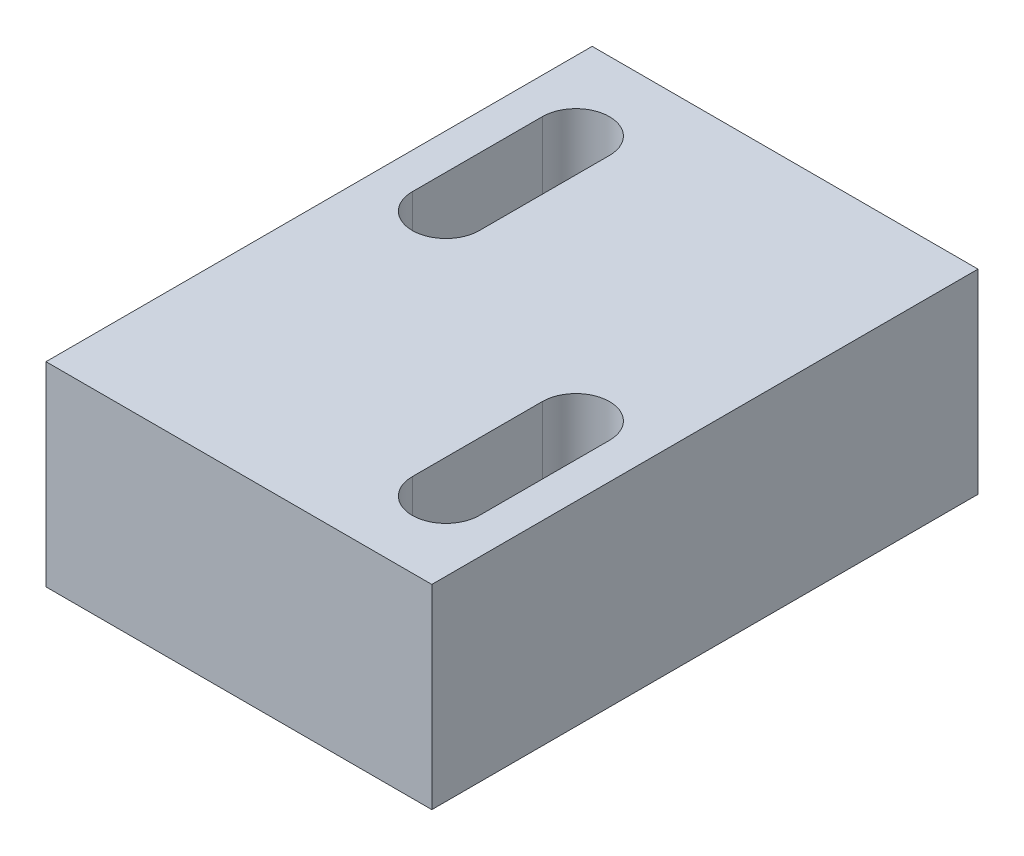
ISO-10303-21;
HEADER;
FILE_DESCRIPTION(('STEP AP214'),'2;1');
FILE_NAME('part.step','',(''),(''),'','','');
FILE_SCHEMA(('AUTOMOTIVE_DESIGN { 1 0 10303 214 1 1 1 1 }'));
ENDSEC;
DATA;
#1=APPLICATION_CONTEXT('core data for automotive mechanical design processes');
#2=APPLICATION_PROTOCOL_DEFINITION('international standard','automotive_design',2000,#1);
#3=PRODUCT_CONTEXT('',#1,'mechanical');
#4=PRODUCT('Part','Part','',(#3));
#5=PRODUCT_RELATED_PRODUCT_CATEGORY('part','',(#4));
#6=PRODUCT_DEFINITION_FORMATION('','',#4);
#7=PRODUCT_DEFINITION_CONTEXT('part definition',#1,'design');
#8=PRODUCT_DEFINITION('design','',#6,#7);
#9=PRODUCT_DEFINITION_SHAPE('','',#8);
#10=(LENGTH_UNIT() NAMED_UNIT(*) SI_UNIT(.MILLI.,.METRE.));
#11=(NAMED_UNIT(*) PLANE_ANGLE_UNIT() SI_UNIT($,.RADIAN.));
#12=(NAMED_UNIT(*) SI_UNIT($,.STERADIAN.) SOLID_ANGLE_UNIT());
#13=UNCERTAINTY_MEASURE_WITH_UNIT(LENGTH_MEASURE(1.E-05),#10,'distance_accuracy_value','');
#14=(GEOMETRIC_REPRESENTATION_CONTEXT(3) GLOBAL_UNCERTAINTY_ASSIGNED_CONTEXT((#13)) GLOBAL_UNIT_ASSIGNED_CONTEXT((#10,
#11,#12)) REPRESENTATION_CONTEXT('',''));
#15=CARTESIAN_POINT('',(0.,0.,0.));
#16=DIRECTION('',(0.,0.,1.));
#17=DIRECTION('',(1.,0.,0.));
#18=AXIS2_PLACEMENT_3D('',#15,#16,#17);
#19=CARTESIAN_POINT('',(-17.5,9.,-12.6));
#20=DIRECTION('',(0.,0.,1.));
#21=DIRECTION('',(1.,0.,0.));
#22=AXIS2_PLACEMENT_3D('',#19,#20,#21);
#23=PLANE('',#22);
#24=DIRECTION('',(-1.,0.,0.));
#25=VECTOR('',#24,1.);
#26=CARTESIAN_POINT('',(-17.5,9.,-12.6));
#27=LINE('',#26,#25);
#28=CARTESIAN_POINT('',(0.301927708294968,9.,-12.6));
#29=VERTEX_POINT('',#28);
#30=CARTESIAN_POINT('',(-17.5,9.,-12.6));
#31=VERTEX_POINT('',#30);
#32=EDGE_CURVE('E141',#29,#31,#27,.T.);
#33=ORIENTED_EDGE('',*,*,#32,.F.);
#34=DIRECTION('',(0.,-1.,0.));
#35=VECTOR('',#34,1.);
#36=CARTESIAN_POINT('',(0.301927708294968,9.,-12.6));
#37=LINE('',#36,#35);
#38=CARTESIAN_POINT('',(0.301927708294968,0.,-12.6));
#39=VERTEX_POINT('',#38);
#40=EDGE_CURVE('E121',#29,#39,#37,.T.);
#41=ORIENTED_EDGE('',*,*,#40,.T.);
#42=DIRECTION('',(-1.,0.,0.));
#43=VECTOR('',#42,1.);
#44=CARTESIAN_POINT('',(-17.5,0.,-12.6));
#45=LINE('',#44,#43);
#46=CARTESIAN_POINT('',(-17.5,0.,-12.6));
#47=VERTEX_POINT('',#46);
#48=EDGE_CURVE('E145',#39,#47,#45,.T.);
#49=ORIENTED_EDGE('',*,*,#48,.T.);
#50=DIRECTION('',(0.,-1.,0.));
#51=VECTOR('',#50,1.);
#52=CARTESIAN_POINT('',(-17.5,9.,-12.6));
#53=LINE('',#52,#51);
#54=EDGE_CURVE('E11',#31,#47,#53,.T.);
#55=ORIENTED_EDGE('',*,*,#54,.F.);
#56=EDGE_LOOP('',(#33,#41,#49,#55));
#57=FACE_BOUND('',#56,.T.);
#58=ADVANCED_FACE('F32',(#57),#23,.F.);
#59=CARTESIAN_POINT('',(-17.5,9.,12.6));
#60=DIRECTION('',(1.,0.,0.));
#61=DIRECTION('',(0.,0.,-1.));
#62=AXIS2_PLACEMENT_3D('',#59,#60,#61);
#63=PLANE('',#62);
#64=DIRECTION('',(0.,0.,1.));
#65=VECTOR('',#64,1.);
#66=CARTESIAN_POINT('',(-17.5,0.,12.6));
#67=LINE('',#66,#65);
#68=CARTESIAN_POINT('',(-17.5,0.,12.6));
#69=VERTEX_POINT('',#68);
#70=EDGE_CURVE('E147',#47,#69,#67,.T.);
#71=ORIENTED_EDGE('',*,*,#70,.T.);
#72=DIRECTION('',(0.,-1.,0.));
#73=VECTOR('',#72,1.);
#74=CARTESIAN_POINT('',(-17.5,9.,12.6));
#75=LINE('',#74,#73);
#76=CARTESIAN_POINT('',(-17.5,9.,12.6));
#77=VERTEX_POINT('',#76);
#78=EDGE_CURVE('E39',#77,#69,#75,.T.);
#79=ORIENTED_EDGE('',*,*,#78,.F.);
#80=DIRECTION('',(0.,0.,1.));
#81=VECTOR('',#80,1.);
#82=CARTESIAN_POINT('',(-17.5,9.,12.6));
#83=LINE('',#82,#81);
#84=EDGE_CURVE('E138',#31,#77,#83,.T.);
#85=ORIENTED_EDGE('',*,*,#84,.F.);
#86=ORIENTED_EDGE('',*,*,#54,.T.);
#87=EDGE_LOOP('',(#71,#79,#85,#86));
#88=FACE_BOUND('',#87,.T.);
#89=ADVANCED_FACE('F221',(#88),#63,.F.);
#90=CARTESIAN_POINT('',(-17.5,9.,12.6));
#91=DIRECTION('',(0.,0.,-1.));
#92=DIRECTION('',(-1.,0.,0.));
#93=AXIS2_PLACEMENT_3D('',#90,#91,#92);
#94=PLANE('',#93);
#95=DIRECTION('',(1.,0.,0.));
#96=VECTOR('',#95,1.);
#97=CARTESIAN_POINT('',(-17.5,0.,12.6));
#98=LINE('',#97,#96);
#99=CARTESIAN_POINT('',(0.301927708294968,0.,12.6));
#100=VERTEX_POINT('',#99);
#101=EDGE_CURVE('E134',#69,#100,#98,.T.);
#102=ORIENTED_EDGE('',*,*,#101,.T.);
#103=DIRECTION('',(0.,-1.,0.));
#104=VECTOR('',#103,1.);
#105=CARTESIAN_POINT('',(0.301927708294968,9.,12.6));
#106=LINE('',#105,#104);
#107=CARTESIAN_POINT('',(0.301927708294968,9.,12.6));
#108=VERTEX_POINT('',#107);
#109=EDGE_CURVE('E46',#108,#100,#106,.T.);
#110=ORIENTED_EDGE('',*,*,#109,.F.);
#111=DIRECTION('',(1.,0.,0.));
#112=VECTOR('',#111,1.);
#113=CARTESIAN_POINT('',(-17.5,9.,12.6));
#114=LINE('',#113,#112);
#115=EDGE_CURVE('E132',#77,#108,#114,.T.);
#116=ORIENTED_EDGE('',*,*,#115,.F.);
#117=ORIENTED_EDGE('',*,*,#78,.T.);
#118=EDGE_LOOP('',(#102,#110,#116,#117));
#119=FACE_BOUND('',#118,.T.);
#120=ADVANCED_FACE('F130',(#119),#94,.F.);
#121=CARTESIAN_POINT('',(0.,9.,0.));
#122=DIRECTION('',(0.,-1.,0.));
#123=DIRECTION('',(0.,0.,-1.));
#124=AXIS2_PLACEMENT_3D('',#121,#122,#123);
#125=PLANE('',#124);
#126=DIRECTION('',(0.,0.,1.));
#127=VECTOR('',#126,1.);
#128=CARTESIAN_POINT('',(-12.7408903953449,9.,-8.64));
#129=LINE('',#128,#127);
#130=CARTESIAN_POINT('',(-12.7408903953449,9.,-8.64));
#131=VERTEX_POINT('',#130);
#132=CARTESIAN_POINT('',(-12.7408903953449,9.,-2.64));
#133=VERTEX_POINT('',#132);
#134=EDGE_CURVE('E188',#131,#133,#129,.T.);
#135=ORIENTED_EDGE('',*,*,#134,.T.);
#136=CARTESIAN_POINT('',(-14.2908903953449,9.,-2.64));
#137=DIRECTION('',(0.,-1.,0.));
#138=DIRECTION('',(0.,0.,-1.));
#139=AXIS2_PLACEMENT_3D('',#136,#137,#138);
#140=CIRCLE('',#139,1.55);
#141=CARTESIAN_POINT('',(-15.8408903953449,9.,-2.64));
#142=VERTEX_POINT('',#141);
#143=EDGE_CURVE('E196',#133,#142,#140,.T.);
#144=ORIENTED_EDGE('',*,*,#143,.T.);
#145=DIRECTION('',(0.,0.,-1.));
#146=VECTOR('',#145,1.);
#147=CARTESIAN_POINT('',(-15.8408903953449,9.,-8.64));
#148=LINE('',#147,#146);
#149=CARTESIAN_POINT('',(-15.8408903953449,9.,-8.64));
#150=VERTEX_POINT('',#149);
#151=EDGE_CURVE('E208',#142,#150,#148,.T.);
#152=ORIENTED_EDGE('',*,*,#151,.T.);
#153=CARTESIAN_POINT('',(-14.2908903953449,9.,-8.64));
#154=DIRECTION('',(0.,-1.,0.));
#155=DIRECTION('',(0.,0.,-1.));
#156=AXIS2_PLACEMENT_3D('',#153,#154,#155);
#157=CIRCLE('',#156,1.55);
#158=EDGE_CURVE('E54',#150,#131,#157,.T.);
#159=ORIENTED_EDGE('',*,*,#158,.T.);
#160=EDGE_LOOP('',(#135,#144,#152,#159));
#161=FACE_BOUND('',#160,.T.);
#162=DIRECTION('',(0.,0.,1.));
#163=VECTOR('',#162,1.);
#164=CARTESIAN_POINT('',(-1.35718189636012,9.,2.74370849898473));
#165=LINE('',#164,#163);
#166=CARTESIAN_POINT('',(-1.35718189636012,9.,2.74370849898473));
#167=VERTEX_POINT('',#166);
#168=CARTESIAN_POINT('',(-1.35718189636012,9.,8.74370849898472));
#169=VERTEX_POINT('',#168);
#170=EDGE_CURVE('E156',#167,#169,#165,.T.);
#171=ORIENTED_EDGE('',*,*,#170,.T.);
#172=CARTESIAN_POINT('',(-2.90718189636012,9.,8.74370849898473));
#173=DIRECTION('',(0.,-1.,0.));
#174=DIRECTION('',(0.,0.,-1.));
#175=AXIS2_PLACEMENT_3D('',#172,#173,#174);
#176=CIRCLE('',#175,1.55);
#177=CARTESIAN_POINT('',(-4.45718189636012,9.,8.74370849898473));
#178=VERTEX_POINT('',#177);
#179=EDGE_CURVE('E164',#169,#178,#176,.T.);
#180=ORIENTED_EDGE('',*,*,#179,.T.);
#181=DIRECTION('',(0.,0.,-1.));
#182=VECTOR('',#181,1.);
#183=CARTESIAN_POINT('',(-4.45718189636012,9.,2.74370849898473));
#184=LINE('',#183,#182);
#185=CARTESIAN_POINT('',(-4.45718189636012,9.,2.74370849898473));
#186=VERTEX_POINT('',#185);
#187=EDGE_CURVE('E179',#178,#186,#184,.T.);
#188=ORIENTED_EDGE('',*,*,#187,.T.);
#189=CARTESIAN_POINT('',(-2.90718189636012,9.,2.74370849898473));
#190=DIRECTION('',(0.,-1.,0.));
#191=DIRECTION('',(0.,0.,-1.));
#192=AXIS2_PLACEMENT_3D('',#189,#190,#191);
#193=CIRCLE('',#192,1.55);
#194=EDGE_CURVE('E176',#186,#167,#193,.T.);
#195=ORIENTED_EDGE('',*,*,#194,.T.);
#196=EDGE_LOOP('',(#171,#180,#188,#195));
#197=FACE_BOUND('',#196,.T.);
#198=ORIENTED_EDGE('',*,*,#115,.T.);
#199=DIRECTION('',(0.,0.,-1.));
#200=VECTOR('',#199,1.);
#201=CARTESIAN_POINT('',(0.301927708294968,9.,-12.6));
#202=LINE('',#201,#200);
#203=EDGE_CURVE('E118',#108,#29,#202,.T.);
#204=ORIENTED_EDGE('',*,*,#203,.T.);
#205=ORIENTED_EDGE('',*,*,#32,.T.);
#206=ORIENTED_EDGE('',*,*,#84,.T.);
#207=EDGE_LOOP('',(#198,#204,#205,#206));
#208=FACE_BOUND('',#207,.T.);
#209=ADVANCED_FACE('F136',(#161,#197,#208),#125,.F.);
#210=CARTESIAN_POINT('',(0.,0.,0.));
#211=DIRECTION('',(0.,-1.,0.));
#212=DIRECTION('',(0.,0.,-1.));
#213=AXIS2_PLACEMENT_3D('',#210,#211,#212);
#214=PLANE('',#213);
#215=DIRECTION('',(0.,0.,-1.));
#216=VECTOR('',#215,1.);
#217=CARTESIAN_POINT('',(0.301927708294968,0.,-12.6));
#218=LINE('',#217,#216);
#219=EDGE_CURVE('E125',#100,#39,#218,.T.);
#220=ORIENTED_EDGE('',*,*,#219,.F.);
#221=ORIENTED_EDGE('',*,*,#101,.F.);
#222=ORIENTED_EDGE('',*,*,#70,.F.);
#223=ORIENTED_EDGE('',*,*,#48,.F.);
#224=EDGE_LOOP('',(#220,#221,#222,#223));
#225=FACE_BOUND('',#224,.T.);
#226=CARTESIAN_POINT('',(-14.2908903953449,0.,-2.64));
#227=DIRECTION('',(0.,-1.,0.));
#228=DIRECTION('',(0.,0.,-1.));
#229=AXIS2_PLACEMENT_3D('',#226,#227,#228);
#230=CIRCLE('',#229,1.55);
#231=CARTESIAN_POINT('',(-12.7408903953449,0.,-2.64));
#232=VERTEX_POINT('',#231);
#233=CARTESIAN_POINT('',(-15.8408903953449,0.,-2.64));
#234=VERTEX_POINT('',#233);
#235=EDGE_CURVE('E203',#232,#234,#230,.T.);
#236=ORIENTED_EDGE('',*,*,#235,.F.);
#237=DIRECTION('',(0.,0.,1.));
#238=VECTOR('',#237,1.);
#239=CARTESIAN_POINT('',(-12.7408903953449,0.,-8.64));
#240=LINE('',#239,#238);
#241=CARTESIAN_POINT('',(-12.7408903953449,0.,-8.64));
#242=VERTEX_POINT('',#241);
#243=EDGE_CURVE('E193',#242,#232,#240,.T.);
#244=ORIENTED_EDGE('',*,*,#243,.F.);
#245=CARTESIAN_POINT('',(-14.2908903953449,0.,-8.64));
#246=DIRECTION('',(0.,-1.,0.));
#247=DIRECTION('',(0.,0.,-1.));
#248=AXIS2_PLACEMENT_3D('',#245,#246,#247);
#249=CIRCLE('',#248,1.55);
#250=CARTESIAN_POINT('',(-15.8408903953449,0.,-8.64));
#251=VERTEX_POINT('',#250);
#252=EDGE_CURVE('E197',#251,#242,#249,.T.);
#253=ORIENTED_EDGE('',*,*,#252,.F.);
#254=DIRECTION('',(0.,0.,-1.));
#255=VECTOR('',#254,1.);
#256=CARTESIAN_POINT('',(-15.8408903953449,0.,-8.64));
#257=LINE('',#256,#255);
#258=EDGE_CURVE('E200',#234,#251,#257,.T.);
#259=ORIENTED_EDGE('',*,*,#258,.F.);
#260=EDGE_LOOP('',(#236,#244,#253,#259));
#261=FACE_BOUND('',#260,.T.);
#262=CARTESIAN_POINT('',(-2.90718189636012,0.,8.74370849898473));
#263=DIRECTION('',(0.,-1.,0.));
#264=DIRECTION('',(0.,0.,-1.));
#265=AXIS2_PLACEMENT_3D('',#262,#263,#264);
#266=CIRCLE('',#265,1.55);
#267=CARTESIAN_POINT('',(-1.35718189636012,0.,8.74370849898472));
#268=VERTEX_POINT('',#267);
#269=CARTESIAN_POINT('',(-4.45718189636012,0.,8.74370849898473));
#270=VERTEX_POINT('',#269);
#271=EDGE_CURVE('E171',#268,#270,#266,.T.);
#272=ORIENTED_EDGE('',*,*,#271,.F.);
#273=DIRECTION('',(0.,0.,1.));
#274=VECTOR('',#273,1.);
#275=CARTESIAN_POINT('',(-1.35718189636012,0.,2.74370849898473));
#276=LINE('',#275,#274);
#277=CARTESIAN_POINT('',(-1.35718189636012,0.,2.74370849898473));
#278=VERTEX_POINT('',#277);
#279=EDGE_CURVE('E161',#278,#268,#276,.T.);
#280=ORIENTED_EDGE('',*,*,#279,.F.);
#281=CARTESIAN_POINT('',(-2.90718189636012,0.,2.74370849898473));
#282=DIRECTION('',(0.,-1.,0.));
#283=DIRECTION('',(0.,0.,-1.));
#284=AXIS2_PLACEMENT_3D('',#281,#282,#283);
#285=CIRCLE('',#284,1.55);
#286=CARTESIAN_POINT('',(-4.45718189636012,0.,2.74370849898473));
#287=VERTEX_POINT('',#286);
#288=EDGE_CURVE('E165',#287,#278,#285,.T.);
#289=ORIENTED_EDGE('',*,*,#288,.F.);
#290=DIRECTION('',(0.,0.,-1.));
#291=VECTOR('',#290,1.);
#292=CARTESIAN_POINT('',(-4.45718189636012,0.,2.74370849898473));
#293=LINE('',#292,#291);
#294=EDGE_CURVE('E168',#270,#287,#293,.T.);
#295=ORIENTED_EDGE('',*,*,#294,.F.);
#296=EDGE_LOOP('',(#272,#280,#289,#295));
#297=FACE_BOUND('',#296,.T.);
#298=ADVANCED_FACE('F218',(#225,#261,#297),#214,.T.);
#299=CARTESIAN_POINT('',(-2.90718189636012,9.,8.74370849898473));
#300=DIRECTION('',(0.,-1.,0.));
#301=DIRECTION('',(0.,0.,-1.));
#302=AXIS2_PLACEMENT_3D('',#299,#300,#301);
#303=CYLINDRICAL_SURFACE('',#302,1.55);
#304=ORIENTED_EDGE('',*,*,#271,.T.);
#305=DIRECTION('',(0.,-1.,0.));
#306=VECTOR('',#305,1.);
#307=CARTESIAN_POINT('',(-4.45718189636012,9.,8.74370849898473));
#308=LINE('',#307,#306);
#309=EDGE_CURVE('E152',#178,#270,#308,.T.);
#310=ORIENTED_EDGE('',*,*,#309,.F.);
#311=ORIENTED_EDGE('',*,*,#179,.F.);
#312=DIRECTION('',(0.,-1.,0.));
#313=VECTOR('',#312,1.);
#314=CARTESIAN_POINT('',(-1.35718189636012,9.,8.74370849898472));
#315=LINE('',#314,#313);
#316=EDGE_CURVE('E148',#169,#268,#315,.T.);
#317=ORIENTED_EDGE('',*,*,#316,.T.);
#318=EDGE_LOOP('',(#304,#310,#311,#317));
#319=FACE_BOUND('',#318,.T.);
#320=ADVANCED_FACE('F231',(#319),#303,.F.);
#321=CARTESIAN_POINT('',(-1.35718189636012,9.,2.74370849898473));
#322=DIRECTION('',(1.,0.,0.));
#323=DIRECTION('',(0.,0.,-1.));
#324=AXIS2_PLACEMENT_3D('',#321,#322,#323);
#325=PLANE('',#324);
#326=ORIENTED_EDGE('',*,*,#279,.T.);
#327=ORIENTED_EDGE('',*,*,#316,.F.);
#328=ORIENTED_EDGE('',*,*,#170,.F.);
#329=DIRECTION('',(0.,-1.,0.));
#330=VECTOR('',#329,1.);
#331=CARTESIAN_POINT('',(-1.35718189636012,9.,2.74370849898473));
#332=LINE('',#331,#330);
#333=EDGE_CURVE('E158',#167,#278,#332,.T.);
#334=ORIENTED_EDGE('',*,*,#333,.T.);
#335=EDGE_LOOP('',(#326,#327,#328,#334));
#336=FACE_BOUND('',#335,.T.);
#337=ADVANCED_FACE('F237',(#336),#325,.F.);
#338=CARTESIAN_POINT('',(-2.90718189636012,9.,2.74370849898473));
#339=DIRECTION('',(0.,-1.,0.));
#340=DIRECTION('',(0.,0.,-1.));
#341=AXIS2_PLACEMENT_3D('',#338,#339,#340);
#342=CYLINDRICAL_SURFACE('',#341,1.55);
#343=ORIENTED_EDGE('',*,*,#288,.T.);
#344=ORIENTED_EDGE('',*,*,#333,.F.);
#345=ORIENTED_EDGE('',*,*,#194,.F.);
#346=DIRECTION('',(0.,-1.,0.));
#347=VECTOR('',#346,1.);
#348=CARTESIAN_POINT('',(-4.45718189636012,9.,2.74370849898473));
#349=LINE('',#348,#347);
#350=EDGE_CURVE('E155',#186,#287,#349,.T.);
#351=ORIENTED_EDGE('',*,*,#350,.T.);
#352=EDGE_LOOP('',(#343,#344,#345,#351));
#353=FACE_BOUND('',#352,.T.);
#354=ADVANCED_FACE('F243',(#353),#342,.F.);
#355=CARTESIAN_POINT('',(-4.45718189636012,9.,2.74370849898473));
#356=DIRECTION('',(-1.,0.,0.));
#357=DIRECTION('',(0.,0.,1.));
#358=AXIS2_PLACEMENT_3D('',#355,#356,#357);
#359=PLANE('',#358);
#360=ORIENTED_EDGE('',*,*,#294,.T.);
#361=ORIENTED_EDGE('',*,*,#350,.F.);
#362=ORIENTED_EDGE('',*,*,#187,.F.);
#363=ORIENTED_EDGE('',*,*,#309,.T.);
#364=EDGE_LOOP('',(#360,#361,#362,#363));
#365=FACE_BOUND('',#364,.T.);
#366=ADVANCED_FACE('F239',(#365),#359,.F.);
#367=CARTESIAN_POINT('',(-14.2908903953449,9.,-2.64));
#368=DIRECTION('',(0.,-1.,0.));
#369=DIRECTION('',(0.,0.,-1.));
#370=AXIS2_PLACEMENT_3D('',#367,#368,#369);
#371=CYLINDRICAL_SURFACE('',#370,1.55);
#372=ORIENTED_EDGE('',*,*,#235,.T.);
#373=DIRECTION('',(0.,-1.,0.));
#374=VECTOR('',#373,1.);
#375=CARTESIAN_POINT('',(-15.8408903953449,9.,-2.64));
#376=LINE('',#375,#374);
#377=EDGE_CURVE('E184',#142,#234,#376,.T.);
#378=ORIENTED_EDGE('',*,*,#377,.F.);
#379=ORIENTED_EDGE('',*,*,#143,.F.);
#380=DIRECTION('',(0.,-1.,0.));
#381=VECTOR('',#380,1.);
#382=CARTESIAN_POINT('',(-12.7408903953449,9.,-2.64));
#383=LINE('',#382,#381);
#384=EDGE_CURVE('E173',#133,#232,#383,.T.);
#385=ORIENTED_EDGE('',*,*,#384,.T.);
#386=EDGE_LOOP('',(#372,#378,#379,#385));
#387=FACE_BOUND('',#386,.T.);
#388=ADVANCED_FACE('F242',(#387),#371,.F.);
#389=CARTESIAN_POINT('',(-12.7408903953449,9.,-8.64));
#390=DIRECTION('',(1.,0.,0.));
#391=DIRECTION('',(0.,0.,-1.));
#392=AXIS2_PLACEMENT_3D('',#389,#390,#391);
#393=PLANE('',#392);
#394=ORIENTED_EDGE('',*,*,#243,.T.);
#395=ORIENTED_EDGE('',*,*,#384,.F.);
#396=ORIENTED_EDGE('',*,*,#134,.F.);
#397=DIRECTION('',(0.,-1.,0.));
#398=VECTOR('',#397,1.);
#399=CARTESIAN_POINT('',(-12.7408903953449,9.,-8.64));
#400=LINE('',#399,#398);
#401=EDGE_CURVE('E190',#131,#242,#400,.T.);
#402=ORIENTED_EDGE('',*,*,#401,.T.);
#403=EDGE_LOOP('',(#394,#395,#396,#402));
#404=FACE_BOUND('',#403,.T.);
#405=ADVANCED_FACE('F253',(#404),#393,.F.);
#406=CARTESIAN_POINT('',(-14.2908903953449,9.,-8.64));
#407=DIRECTION('',(0.,-1.,0.));
#408=DIRECTION('',(0.,0.,-1.));
#409=AXIS2_PLACEMENT_3D('',#406,#407,#408);
#410=CYLINDRICAL_SURFACE('',#409,1.55);
#411=ORIENTED_EDGE('',*,*,#252,.T.);
#412=ORIENTED_EDGE('',*,*,#401,.F.);
#413=ORIENTED_EDGE('',*,*,#158,.F.);
#414=DIRECTION('',(0.,-1.,0.));
#415=VECTOR('',#414,1.);
#416=CARTESIAN_POINT('',(-15.8408903953449,9.,-8.64));
#417=LINE('',#416,#415);
#418=EDGE_CURVE('E187',#150,#251,#417,.T.);
#419=ORIENTED_EDGE('',*,*,#418,.T.);
#420=EDGE_LOOP('',(#411,#412,#413,#419));
#421=FACE_BOUND('',#420,.T.);
#422=ADVANCED_FACE('F258',(#421),#410,.F.);
#423=CARTESIAN_POINT('',(-15.8408903953449,9.,-8.64));
#424=DIRECTION('',(-1.,0.,0.));
#425=DIRECTION('',(0.,0.,1.));
#426=AXIS2_PLACEMENT_3D('',#423,#424,#425);
#427=PLANE('',#426);
#428=ORIENTED_EDGE('',*,*,#258,.T.);
#429=ORIENTED_EDGE('',*,*,#418,.F.);
#430=ORIENTED_EDGE('',*,*,#151,.F.);
#431=ORIENTED_EDGE('',*,*,#377,.T.);
#432=EDGE_LOOP('',(#428,#429,#430,#431));
#433=FACE_BOUND('',#432,.T.);
#434=ADVANCED_FACE('F255',(#433),#427,.F.);
#435=CARTESIAN_POINT('',(0.301927708294968,9.,-12.6));
#436=DIRECTION('',(-1.,0.,0.));
#437=DIRECTION('',(0.,0.,1.));
#438=AXIS2_PLACEMENT_3D('',#435,#436,#437);
#439=PLANE('',#438);
#440=ORIENTED_EDGE('',*,*,#219,.T.);
#441=ORIENTED_EDGE('',*,*,#40,.F.);
#442=ORIENTED_EDGE('',*,*,#203,.F.);
#443=ORIENTED_EDGE('',*,*,#109,.T.);
#444=EDGE_LOOP('',(#440,#441,#442,#443));
#445=FACE_BOUND('',#444,.T.);
#446=ADVANCED_FACE('F119',(#445),#439,.F.);
#447=CLOSED_SHELL('',(#58,#89,#120,#209,#298,#320,#337,#354,#366,#388,#405,#422,#434,#446));
#448=MANIFOLD_SOLID_BREP('B2',#447);
#449=ADVANCED_BREP_SHAPE_REPRESENTATION('',(#18,#448),#14);
#450=SHAPE_DEFINITION_REPRESENTATION(#9,#449);
ENDSEC;
END-ISO-10303-21;
